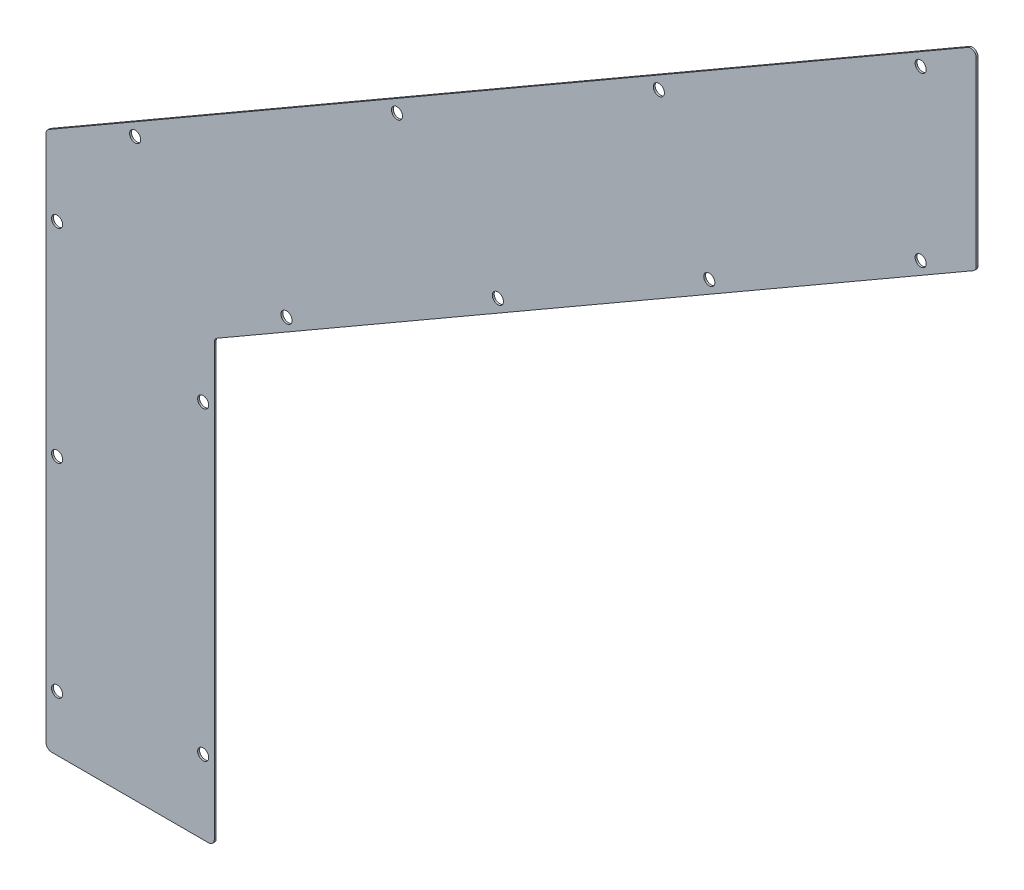
ISO-10303-21;
HEADER;
FILE_DESCRIPTION(('STEP AP214'),'2;1');
FILE_NAME('part.step','',(''),(''),'','','');
FILE_SCHEMA(('AUTOMOTIVE_DESIGN { 1 0 10303 214 1 1 1 1 }'));
ENDSEC;
DATA;
#1=APPLICATION_CONTEXT('core data for automotive mechanical design processes');
#2=APPLICATION_PROTOCOL_DEFINITION('international standard','automotive_design',2000,#1);
#3=PRODUCT_CONTEXT('',#1,'mechanical');
#4=PRODUCT('Part','Part','',(#3));
#5=PRODUCT_RELATED_PRODUCT_CATEGORY('part','',(#4));
#6=PRODUCT_DEFINITION_FORMATION('','',#4);
#7=PRODUCT_DEFINITION_CONTEXT('part definition',#1,'design');
#8=PRODUCT_DEFINITION('design','',#6,#7);
#9=PRODUCT_DEFINITION_SHAPE('','',#8);
#10=(LENGTH_UNIT() NAMED_UNIT(*) SI_UNIT(.MILLI.,.METRE.));
#11=(NAMED_UNIT(*) PLANE_ANGLE_UNIT() SI_UNIT($,.RADIAN.));
#12=(NAMED_UNIT(*) SI_UNIT($,.STERADIAN.) SOLID_ANGLE_UNIT());
#13=UNCERTAINTY_MEASURE_WITH_UNIT(LENGTH_MEASURE(1.E-05),#10,'distance_accuracy_value','');
#14=(GEOMETRIC_REPRESENTATION_CONTEXT(3) GLOBAL_UNCERTAINTY_ASSIGNED_CONTEXT((#13)) GLOBAL_UNIT_ASSIGNED_CONTEXT((#10,
#11,#12)) REPRESENTATION_CONTEXT('',''));
#15=CARTESIAN_POINT('',(0.,0.,0.));
#16=DIRECTION('',(0.,0.,1.));
#17=DIRECTION('',(1.,0.,0.));
#18=AXIS2_PLACEMENT_3D('',#15,#16,#17);
#19=CARTESIAN_POINT('',(-91.,0.,-1.));
#20=DIRECTION('',(0.,-1.,0.));
#21=DIRECTION('',(0.,0.,-1.));
#22=AXIS2_PLACEMENT_3D('',#19,#20,#21);
#23=PLANE('',#22);
#24=DIRECTION('',(1.,0.,0.));
#25=VECTOR('',#24,1.);
#26=CARTESIAN_POINT('',(-91.,0.,0.));
#27=LINE('',#26,#25);
#28=CARTESIAN_POINT('',(-88.,0.,0.));
#29=VERTEX_POINT('',#28);
#30=CARTESIAN_POINT('',(-3.,0.,0.));
#31=VERTEX_POINT('',#30);
#32=EDGE_CURVE('E241',#29,#31,#27,.T.);
#33=ORIENTED_EDGE('',*,*,#32,.F.);
#34=DIRECTION('',(0.,0.,1.));
#35=VECTOR('',#34,1.);
#36=CARTESIAN_POINT('',(-88.,0.,-1.));
#37=LINE('',#36,#35);
#38=CARTESIAN_POINT('',(-88.,0.,-1.));
#39=VERTEX_POINT('',#38);
#40=EDGE_CURVE('E187',#29,#39,#37,.F.);
#41=ORIENTED_EDGE('',*,*,#40,.T.);
#42=DIRECTION('',(1.,0.,0.));
#43=VECTOR('',#42,1.);
#44=CARTESIAN_POINT('',(-91.,0.,-1.));
#45=LINE('',#44,#43);
#46=CARTESIAN_POINT('',(-3.,0.,-1.));
#47=VERTEX_POINT('',#46);
#48=EDGE_CURVE('E274',#39,#47,#45,.T.);
#49=ORIENTED_EDGE('',*,*,#48,.T.);
#50=DIRECTION('',(0.,0.,1.));
#51=VECTOR('',#50,1.);
#52=CARTESIAN_POINT('',(-3.,0.,-1.));
#53=LINE('',#52,#51);
#54=EDGE_CURVE('E184',#47,#31,#53,.T.);
#55=ORIENTED_EDGE('',*,*,#54,.T.);
#56=EDGE_LOOP('',(#33,#41,#49,#55));
#57=FACE_BOUND('',#56,.T.);
#58=ADVANCED_FACE('F40',(#57),#23,.T.);
#59=CARTESIAN_POINT('',(-91.,290.01,-1.));
#60=DIRECTION('',(-1.,0.,0.));
#61=DIRECTION('',(0.,-1.,0.));
#62=AXIS2_PLACEMENT_3D('',#59,#60,#61);
#63=PLANE('',#62);
#64=DIRECTION('',(0.,-1.,0.));
#65=VECTOR('',#64,1.);
#66=CARTESIAN_POINT('',(-91.,290.01,0.));
#67=LINE('',#66,#65);
#68=CARTESIAN_POINT('',(-91.,288.277949192431,0.));
#69=VERTEX_POINT('',#68);
#70=CARTESIAN_POINT('',(-91.,3.,0.));
#71=VERTEX_POINT('',#70);
#72=EDGE_CURVE('E151',#69,#71,#67,.T.);
#73=ORIENTED_EDGE('',*,*,#72,.F.);
#74=DIRECTION('',(0.,0.,1.));
#75=VECTOR('',#74,1.);
#76=CARTESIAN_POINT('',(-91.,288.277949192431,-1.));
#77=LINE('',#76,#75);
#78=CARTESIAN_POINT('',(-91.,288.277949192431,-1.));
#79=VERTEX_POINT('',#78);
#80=EDGE_CURVE('E173',#69,#79,#77,.F.);
#81=ORIENTED_EDGE('',*,*,#80,.T.);
#82=DIRECTION('',(0.,-1.,0.));
#83=VECTOR('',#82,1.);
#84=CARTESIAN_POINT('',(-91.,290.01,-1.));
#85=LINE('',#84,#83);
#86=CARTESIAN_POINT('',(-91.,3.,-1.));
#87=VERTEX_POINT('',#86);
#88=EDGE_CURVE('E155',#79,#87,#85,.T.);
#89=ORIENTED_EDGE('',*,*,#88,.T.);
#90=DIRECTION('',(0.,0.,1.));
#91=VECTOR('',#90,1.);
#92=CARTESIAN_POINT('',(-91.,3.,-1.));
#93=LINE('',#92,#91);
#94=EDGE_CURVE('E170',#87,#71,#93,.T.);
#95=ORIENTED_EDGE('',*,*,#94,.T.);
#96=EDGE_LOOP('',(#73,#81,#89,#95));
#97=FACE_BOUND('',#96,.T.);
#98=ADVANCED_FACE('F293',(#97),#63,.T.);
#99=CARTESIAN_POINT('',(412.,580.41718540238,-1.));
#100=DIRECTION('',(-0.499999999999998,0.86602540378444,0.));
#101=DIRECTION('',(-0.86602540378444,-0.499999999999998,0.));
#102=AXIS2_PLACEMENT_3D('',#99,#100,#101);
#103=PLANE('',#102);
#104=DIRECTION('',(-0.86602540378444,-0.499999999999998,0.));
#105=VECTOR('',#104,1.);
#106=CARTESIAN_POINT('',(412.,580.41718540238,-1.));
#107=LINE('',#106,#105);
#108=CARTESIAN_POINT('',(407.5,577.819109191027,-1.));
#109=VERTEX_POINT('',#108);
#110=CARTESIAN_POINT('',(-89.4999999999999,290.876025403784,-1.));
#111=VERTEX_POINT('',#110);
#112=EDGE_CURVE('E159',#109,#111,#107,.T.);
#113=ORIENTED_EDGE('',*,*,#112,.T.);
#114=DIRECTION('',(0.,0.,1.));
#115=VECTOR('',#114,1.);
#116=CARTESIAN_POINT('',(-89.5,290.876025403784,-1.));
#117=LINE('',#116,#115);
#118=CARTESIAN_POINT('',(-89.4999999999999,290.876025403784,0.));
#119=VERTEX_POINT('',#118);
#120=EDGE_CURVE('E142',#111,#119,#117,.T.);
#121=ORIENTED_EDGE('',*,*,#120,.T.);
#122=DIRECTION('',(-0.86602540378444,-0.499999999999998,0.));
#123=VECTOR('',#122,1.);
#124=CARTESIAN_POINT('',(412.,580.41718540238,0.));
#125=LINE('',#124,#123);
#126=CARTESIAN_POINT('',(407.5,577.819109191027,0.));
#127=VERTEX_POINT('',#126);
#128=EDGE_CURVE('E134',#127,#119,#125,.T.);
#129=ORIENTED_EDGE('',*,*,#128,.F.);
#130=DIRECTION('',(0.,0.,1.));
#131=VECTOR('',#130,1.);
#132=CARTESIAN_POINT('',(407.5,577.819109191027,-1.));
#133=LINE('',#132,#131);
#134=EDGE_CURVE('E148',#127,#109,#133,.F.);
#135=ORIENTED_EDGE('',*,*,#134,.T.);
#136=EDGE_LOOP('',(#113,#121,#129,#135));
#137=FACE_BOUND('',#136,.T.);
#138=ADVANCED_FACE('F147',(#137),#103,.T.);
#139=CARTESIAN_POINT('',(412.,475.605017533696,-1.));
#140=DIRECTION('',(1.,0.,0.));
#141=DIRECTION('',(0.,0.,-1.));
#142=AXIS2_PLACEMENT_3D('',#139,#140,#141);
#143=PLANE('',#142);
#144=DIRECTION('',(0.,1.,0.));
#145=VECTOR('',#144,1.);
#146=CARTESIAN_POINT('',(412.,475.605017533696,0.));
#147=LINE('',#146,#145);
#148=CARTESIAN_POINT('',(412.,477.337068341265,0.));
#149=VERTEX_POINT('',#148);
#150=CARTESIAN_POINT('',(412.,575.221032979674,0.));
#151=VERTEX_POINT('',#150);
#152=EDGE_CURVE('E136',#149,#151,#147,.T.);
#153=ORIENTED_EDGE('',*,*,#152,.F.);
#154=DIRECTION('',(0.,0.,1.));
#155=VECTOR('',#154,1.);
#156=CARTESIAN_POINT('',(412.,477.337068341265,-1.));
#157=LINE('',#156,#155);
#158=CARTESIAN_POINT('',(412.,477.337068341265,-1.));
#159=VERTEX_POINT('',#158);
#160=EDGE_CURVE('E200',#149,#159,#157,.F.);
#161=ORIENTED_EDGE('',*,*,#160,.T.);
#162=DIRECTION('',(0.,1.,0.));
#163=VECTOR('',#162,1.);
#164=CARTESIAN_POINT('',(412.,475.605017533696,-1.));
#165=LINE('',#164,#163);
#166=CARTESIAN_POINT('',(412.,575.221032979674,-1.));
#167=VERTEX_POINT('',#166);
#168=EDGE_CURVE('E285',#159,#167,#165,.T.);
#169=ORIENTED_EDGE('',*,*,#168,.T.);
#170=DIRECTION('',(0.,0.,1.));
#171=VECTOR('',#170,1.);
#172=CARTESIAN_POINT('',(412.,575.221032979674,-1.));
#173=LINE('',#172,#171);
#174=EDGE_CURVE('E198',#167,#151,#173,.T.);
#175=ORIENTED_EDGE('',*,*,#174,.T.);
#176=EDGE_LOOP('',(#153,#161,#169,#175));
#177=FACE_BOUND('',#176,.T.);
#178=ADVANCED_FACE('F338',(#177),#143,.T.);
#179=CARTESIAN_POINT('',(0.,237.736706627571,-1.));
#180=DIRECTION('',(0.499999999999998,-0.86602540378444,0.));
#181=DIRECTION('',(0.86602540378444,0.499999999999998,0.));
#182=AXIS2_PLACEMENT_3D('',#179,#180,#181);
#183=PLANE('',#182);
#184=DIRECTION('',(0.86602540378444,0.499999999999998,0.));
#185=VECTOR('',#184,1.);
#186=CARTESIAN_POINT('',(0.,237.736706627571,0.));
#187=LINE('',#186,#185);
#188=CARTESIAN_POINT('',(1.50000000000001,238.602732031356,0.));
#189=VERTEX_POINT('',#188);
#190=CARTESIAN_POINT('',(410.5,474.738992129911,0.));
#191=VERTEX_POINT('',#190);
#192=EDGE_CURVE('E249',#189,#191,#187,.T.);
#193=ORIENTED_EDGE('',*,*,#192,.F.);
#194=DIRECTION('',(0.,0.,1.));
#195=VECTOR('',#194,1.);
#196=CARTESIAN_POINT('',(1.50000000000001,238.602732031356,-1.));
#197=LINE('',#196,#195);
#198=CARTESIAN_POINT('',(1.50000000000001,238.602732031356,-1.));
#199=VERTEX_POINT('',#198);
#200=EDGE_CURVE('E196',#189,#199,#197,.F.);
#201=ORIENTED_EDGE('',*,*,#200,.T.);
#202=DIRECTION('',(0.86602540378444,0.499999999999998,0.));
#203=VECTOR('',#202,1.);
#204=CARTESIAN_POINT('',(0.,237.736706627571,-1.));
#205=LINE('',#204,#203);
#206=CARTESIAN_POINT('',(410.5,474.738992129911,-1.));
#207=VERTEX_POINT('',#206);
#208=EDGE_CURVE('E277',#199,#207,#205,.T.);
#209=ORIENTED_EDGE('',*,*,#208,.T.);
#210=DIRECTION('',(0.,0.,1.));
#211=VECTOR('',#210,1.);
#212=CARTESIAN_POINT('',(410.5,474.738992129911,-1.));
#213=LINE('',#212,#211);
#214=EDGE_CURVE('E193',#207,#191,#213,.T.);
#215=ORIENTED_EDGE('',*,*,#214,.T.);
#216=EDGE_LOOP('',(#193,#201,#209,#215));
#217=FACE_BOUND('',#216,.T.);
#218=ADVANCED_FACE('F258',(#217),#183,.T.);
#219=CARTESIAN_POINT('',(0.,0.,-1.));
#220=DIRECTION('',(1.,0.,0.));
#221=DIRECTION('',(0.,0.,-1.));
#222=AXIS2_PLACEMENT_3D('',#219,#220,#221);
#223=PLANE('',#222);
#224=DIRECTION('',(0.,1.,0.));
#225=VECTOR('',#224,1.);
#226=CARTESIAN_POINT('',(0.,0.,0.));
#227=LINE('',#226,#225);
#228=CARTESIAN_POINT('',(0.,3.,0.));
#229=VERTEX_POINT('',#228);
#230=CARTESIAN_POINT('',(0.,236.004655820002,0.));
#231=VERTEX_POINT('',#230);
#232=EDGE_CURVE('E245',#229,#231,#227,.T.);
#233=ORIENTED_EDGE('',*,*,#232,.F.);
#234=DIRECTION('',(0.,0.,1.));
#235=VECTOR('',#234,1.);
#236=CARTESIAN_POINT('',(0.,3.,-1.));
#237=LINE('',#236,#235);
#238=CARTESIAN_POINT('',(0.,3.,-1.));
#239=VERTEX_POINT('',#238);
#240=EDGE_CURVE('E62',#229,#239,#237,.F.);
#241=ORIENTED_EDGE('',*,*,#240,.T.);
#242=DIRECTION('',(0.,1.,0.));
#243=VECTOR('',#242,1.);
#244=CARTESIAN_POINT('',(0.,0.,-1.));
#245=LINE('',#244,#243);
#246=CARTESIAN_POINT('',(0.,236.004655820002,-1.));
#247=VERTEX_POINT('',#246);
#248=EDGE_CURVE('E265',#239,#247,#245,.T.);
#249=ORIENTED_EDGE('',*,*,#248,.T.);
#250=DIRECTION('',(0.,0.,1.));
#251=VECTOR('',#250,1.);
#252=CARTESIAN_POINT('',(0.,236.004655820002,0.));
#253=LINE('',#252,#251);
#254=EDGE_CURVE('E189',#247,#231,#253,.T.);
#255=ORIENTED_EDGE('',*,*,#254,.T.);
#256=EDGE_LOOP('',(#233,#241,#249,#255));
#257=FACE_BOUND('',#256,.T.);
#258=ADVANCED_FACE('F264',(#257),#223,.T.);
#259=CARTESIAN_POINT('',(0.,0.,-1.));
#260=DIRECTION('',(0.,0.,1.));
#261=DIRECTION('',(1.,0.,0.));
#262=AXIS2_PLACEMENT_3D('',#259,#260,#261);
#263=PLANE('',#262);
#264=CARTESIAN_POINT('',(382.,556.168474096416,-1.));
#265=DIRECTION('',(0.,0.,-1.));
#266=DIRECTION('',(-1.,0.,0.));
#267=AXIS2_PLACEMENT_3D('',#264,#265,#266);
#268=CIRCLE('',#267,2.99999999999999);
#269=CARTESIAN_POINT('',(379.,556.168474096416,-1.));
#270=VERTEX_POINT('',#269);
#271=EDGE_CURVE('E207',#270,#270,#268,.T.);
#272=ORIENTED_EDGE('',*,*,#271,.F.);
#273=EDGE_LOOP('',(#272));
#274=FACE_BOUND('',#273,.T.);
#275=CARTESIAN_POINT('',(-6.00000000000001,205.,-1.));
#276=DIRECTION('',(0.,0.,-1.));
#277=DIRECTION('',(-1.,0.,0.));
#278=AXIS2_PLACEMENT_3D('',#275,#276,#277);
#279=CIRCLE('',#278,3.);
#280=CARTESIAN_POINT('',(-9.00000000000001,205.,-1.));
#281=VERTEX_POINT('',#280);
#282=EDGE_CURVE('E608',#281,#281,#279,.T.);
#283=ORIENTED_EDGE('',*,*,#282,.F.);
#284=EDGE_LOOP('',(#283));
#285=FACE_BOUND('',#284,.T.);
#286=CARTESIAN_POINT('',(-84.9999999999992,250.,-1.));
#287=DIRECTION('',(0.,0.,-1.));
#288=DIRECTION('',(-1.,0.,0.));
#289=AXIS2_PLACEMENT_3D('',#286,#287,#288);
#290=CIRCLE('',#289,3.00000000000001);
#291=CARTESIAN_POINT('',(-87.9999999999992,250.,-1.));
#292=VERTEX_POINT('',#291);
#293=EDGE_CURVE('E605',#292,#292,#290,.T.);
#294=ORIENTED_EDGE('',*,*,#293,.F.);
#295=EDGE_LOOP('',(#294));
#296=FACE_BOUND('',#295,.T.);
#297=CARTESIAN_POINT('',(-84.9999999999996,140.,-1.));
#298=DIRECTION('',(0.,0.,-1.));
#299=DIRECTION('',(-1.,0.,0.));
#300=AXIS2_PLACEMENT_3D('',#297,#298,#299);
#301=CIRCLE('',#300,3.00000000000001);
#302=CARTESIAN_POINT('',(-87.9999999999996,140.,-1.));
#303=VERTEX_POINT('',#302);
#304=EDGE_CURVE('E602',#303,#303,#301,.T.);
#305=ORIENTED_EDGE('',*,*,#304,.F.);
#306=EDGE_LOOP('',(#305));
#307=FACE_BOUND('',#306,.T.);
#308=CARTESIAN_POINT('',(-6.00000000000001,40.,-1.));
#309=DIRECTION('',(0.,0.,-1.));
#310=DIRECTION('',(-1.,0.,0.));
#311=AXIS2_PLACEMENT_3D('',#308,#309,#310);
#312=CIRCLE('',#311,3.);
#313=CARTESIAN_POINT('',(-9.00000000000001,40.,-1.));
#314=VERTEX_POINT('',#313);
#315=EDGE_CURVE('E598',#314,#314,#312,.T.);
#316=ORIENTED_EDGE('',*,*,#315,.F.);
#317=EDGE_LOOP('',(#316));
#318=FACE_BOUND('',#317,.T.);
#319=CARTESIAN_POINT('',(382.,465.212712688284,-1.));
#320=DIRECTION('',(0.,0.,-1.));
#321=DIRECTION('',(-1.,0.,0.));
#322=AXIS2_PLACEMENT_3D('',#319,#320,#321);
#323=CIRCLE('',#322,2.99999999999999);
#324=CARTESIAN_POINT('',(379.,465.212712688284,-1.));
#325=VERTEX_POINT('',#324);
#326=EDGE_CURVE('E592',#325,#325,#323,.T.);
#327=ORIENTED_EDGE('',*,*,#326,.F.);
#328=EDGE_LOOP('',(#327));
#329=FACE_BOUND('',#328,.T.);
#330=CARTESIAN_POINT('',(240.404846481244,474.418474096416,-1.));
#331=DIRECTION('',(0.,0.,-1.));
#332=DIRECTION('',(-1.,0.,0.));
#333=AXIS2_PLACEMENT_3D('',#330,#331,#332);
#334=CIRCLE('',#333,2.99999999999999);
#335=CARTESIAN_POINT('',(237.404846481244,474.418474096416,-1.));
#336=VERTEX_POINT('',#335);
#337=EDGE_CURVE('E595',#336,#336,#334,.T.);
#338=ORIENTED_EDGE('',*,*,#337,.F.);
#339=EDGE_LOOP('',(#338));
#340=FACE_BOUND('',#339,.T.);
#341=CARTESIAN_POINT('',(98.8096929624882,392.668474096417,-1.));
#342=DIRECTION('',(0.,0.,-1.));
#343=DIRECTION('',(-1.,0.,0.));
#344=AXIS2_PLACEMENT_3D('',#341,#342,#343);
#345=CIRCLE('',#344,3.00000000000001);
#346=CARTESIAN_POINT('',(95.8096929624882,392.668474096417,-1.));
#347=VERTEX_POINT('',#346);
#348=EDGE_CURVE('E623',#347,#347,#345,.T.);
#349=ORIENTED_EDGE('',*,*,#348,.F.);
#350=EDGE_LOOP('',(#349));
#351=FACE_BOUND('',#350,.T.);
#352=CARTESIAN_POINT('',(-42.7854605562677,310.918474096417,-1.));
#353=DIRECTION('',(0.,0.,-1.));
#354=DIRECTION('',(-1.,0.,0.));
#355=AXIS2_PLACEMENT_3D('',#352,#353,#354);
#356=CIRCLE('',#355,3.);
#357=CARTESIAN_POINT('',(-45.7854605562677,310.918474096417,-1.));
#358=VERTEX_POINT('',#357);
#359=EDGE_CURVE('E281',#358,#358,#356,.T.);
#360=ORIENTED_EDGE('',*,*,#359,.F.);
#361=EDGE_LOOP('',(#360));
#362=FACE_BOUND('',#361,.T.);
#363=CARTESIAN_POINT('',(39.0539401013619,267.212712688284,-1.));
#364=DIRECTION('',(0.,0.,-1.));
#365=DIRECTION('',(-1.,0.,0.));
#366=AXIS2_PLACEMENT_3D('',#363,#364,#365);
#367=CIRCLE('',#366,3.);
#368=CARTESIAN_POINT('',(36.0539401013619,267.212712688284,-1.));
#369=VERTEX_POINT('',#368);
#370=EDGE_CURVE('E601',#369,#369,#367,.T.);
#371=ORIENTED_EDGE('',*,*,#370,.F.);
#372=EDGE_LOOP('',(#371));
#373=FACE_BOUND('',#372,.T.);
#374=CARTESIAN_POINT('',(153.369293400908,333.212712688284,-1.));
#375=DIRECTION('',(0.,0.,-1.));
#376=DIRECTION('',(-1.,0.,0.));
#377=AXIS2_PLACEMENT_3D('',#374,#375,#376);
#378=CIRCLE('',#377,2.99999999999999);
#379=CARTESIAN_POINT('',(150.369293400908,333.212712688284,-1.));
#380=VERTEX_POINT('',#379);
#381=EDGE_CURVE('E611',#380,#380,#378,.T.);
#382=ORIENTED_EDGE('',*,*,#381,.F.);
#383=EDGE_LOOP('',(#382));
#384=FACE_BOUND('',#383,.T.);
#385=CARTESIAN_POINT('',(267.684646700454,399.212712688284,-1.));
#386=DIRECTION('',(0.,0.,-1.));
#387=DIRECTION('',(-1.,0.,0.));
#388=AXIS2_PLACEMENT_3D('',#385,#386,#387);
#389=CIRCLE('',#388,2.99999999999999);
#390=CARTESIAN_POINT('',(264.684646700454,399.212712688284,-1.));
#391=VERTEX_POINT('',#390);
#392=EDGE_CURVE('E614',#391,#391,#389,.T.);
#393=ORIENTED_EDGE('',*,*,#392,.F.);
#394=EDGE_LOOP('',(#393));
#395=FACE_BOUND('',#394,.T.);
#396=CARTESIAN_POINT('',(-85.,30.,-1.));
#397=DIRECTION('',(0.,0.,-1.));
#398=DIRECTION('',(-1.,0.,0.));
#399=AXIS2_PLACEMENT_3D('',#396,#397,#398);
#400=CIRCLE('',#399,3.00000000000001);
#401=CARTESIAN_POINT('',(-88.,30.,-1.));
#402=VERTEX_POINT('',#401);
#403=EDGE_CURVE('E617',#402,#402,#400,.T.);
#404=ORIENTED_EDGE('',*,*,#403,.F.);
#405=EDGE_LOOP('',(#404));
#406=FACE_BOUND('',#405,.T.);
#407=ORIENTED_EDGE('',*,*,#88,.F.);
#408=CARTESIAN_POINT('',(-88.,288.277949192431,-1.));
#409=DIRECTION('',(0.,0.,1.));
#410=DIRECTION('',(1.,0.,0.));
#411=AXIS2_PLACEMENT_3D('',#408,#409,#410);
#412=CIRCLE('',#411,3.);
#413=EDGE_CURVE('E182',#79,#111,#412,.F.);
#414=ORIENTED_EDGE('',*,*,#413,.T.);
#415=ORIENTED_EDGE('',*,*,#112,.F.);
#416=CARTESIAN_POINT('',(409.,575.221032979674,-1.));
#417=DIRECTION('',(0.,0.,1.));
#418=DIRECTION('',(1.,0.,0.));
#419=AXIS2_PLACEMENT_3D('',#416,#417,#418);
#420=CIRCLE('',#419,3.);
#421=EDGE_CURVE('E154',#109,#167,#420,.F.);
#422=ORIENTED_EDGE('',*,*,#421,.T.);
#423=ORIENTED_EDGE('',*,*,#168,.F.);
#424=CARTESIAN_POINT('',(409.,477.337068341265,-1.));
#425=DIRECTION('',(0.,0.,1.));
#426=DIRECTION('',(1.,0.,0.));
#427=AXIS2_PLACEMENT_3D('',#424,#425,#426);
#428=CIRCLE('',#427,3.);
#429=EDGE_CURVE('E176',#159,#207,#428,.F.);
#430=ORIENTED_EDGE('',*,*,#429,.T.);
#431=ORIENTED_EDGE('',*,*,#208,.F.);
#432=CARTESIAN_POINT('',(3.,236.004655820002,-1.));
#433=DIRECTION('',(0.,0.,1.));
#434=DIRECTION('',(1.,0.,0.));
#435=AXIS2_PLACEMENT_3D('',#432,#433,#434);
#436=CIRCLE('',#435,3.);
#437=EDGE_CURVE('E11',#199,#247,#436,.T.);
#438=ORIENTED_EDGE('',*,*,#437,.T.);
#439=ORIENTED_EDGE('',*,*,#248,.F.);
#440=CARTESIAN_POINT('',(-3.,3.,-1.));
#441=DIRECTION('',(0.,0.,1.));
#442=DIRECTION('',(1.,0.,0.));
#443=AXIS2_PLACEMENT_3D('',#440,#441,#442);
#444=CIRCLE('',#443,3.);
#445=EDGE_CURVE('E178',#239,#47,#444,.F.);
#446=ORIENTED_EDGE('',*,*,#445,.T.);
#447=ORIENTED_EDGE('',*,*,#48,.F.);
#448=CARTESIAN_POINT('',(-88.,3.,-1.));
#449=DIRECTION('',(0.,0.,1.));
#450=DIRECTION('',(1.,0.,0.));
#451=AXIS2_PLACEMENT_3D('',#448,#449,#450);
#452=CIRCLE('',#451,3.);
#453=EDGE_CURVE('E180',#39,#87,#452,.F.);
#454=ORIENTED_EDGE('',*,*,#453,.T.);
#455=EDGE_LOOP('',(#407,#414,#415,#422,#423,#430,#431,#438,#439,#446,#447,#454));
#456=FACE_BOUND('',#455,.T.);
#457=ADVANCED_FACE('F298',(#274,#285,#296,#307,#318,#329,#340,#351,#362,#373,#384,#395,#406,
#456),#263,.F.);
#458=CARTESIAN_POINT('',(0.,0.,0.));
#459=DIRECTION('',(0.,0.,1.));
#460=DIRECTION('',(1.,0.,0.));
#461=AXIS2_PLACEMENT_3D('',#458,#459,#460);
#462=PLANE('',#461);
#463=CARTESIAN_POINT('',(382.,556.168474096416,0.));
#464=DIRECTION('',(0.,0.,1.));
#465=DIRECTION('',(1.,0.,0.));
#466=AXIS2_PLACEMENT_3D('',#463,#464,#465);
#467=CIRCLE('',#466,2.99999999999999);
#468=CARTESIAN_POINT('',(385.,556.168474096416,0.));
#469=VERTEX_POINT('',#468);
#470=EDGE_CURVE('E44',#469,#469,#467,.T.);
#471=ORIENTED_EDGE('',*,*,#470,.F.);
#472=EDGE_LOOP('',(#471));
#473=FACE_BOUND('',#472,.T.);
#474=CARTESIAN_POINT('',(-6.00000000000001,205.,0.));
#475=DIRECTION('',(0.,0.,1.));
#476=DIRECTION('',(1.,0.,0.));
#477=AXIS2_PLACEMENT_3D('',#474,#475,#476);
#478=CIRCLE('',#477,3.);
#479=CARTESIAN_POINT('',(-3.00000000000001,205.,0.));
#480=VERTEX_POINT('',#479);
#481=EDGE_CURVE('E236',#480,#480,#478,.T.);
#482=ORIENTED_EDGE('',*,*,#481,.F.);
#483=EDGE_LOOP('',(#482));
#484=FACE_BOUND('',#483,.T.);
#485=CARTESIAN_POINT('',(-84.9999999999992,250.,0.));
#486=DIRECTION('',(0.,0.,1.));
#487=DIRECTION('',(1.,0.,0.));
#488=AXIS2_PLACEMENT_3D('',#485,#486,#487);
#489=CIRCLE('',#488,3.00000000000001);
#490=CARTESIAN_POINT('',(-81.9999999999992,250.,0.));
#491=VERTEX_POINT('',#490);
#492=EDGE_CURVE('E234',#491,#491,#489,.T.);
#493=ORIENTED_EDGE('',*,*,#492,.F.);
#494=EDGE_LOOP('',(#493));
#495=FACE_BOUND('',#494,.T.);
#496=CARTESIAN_POINT('',(-84.9999999999996,140.,0.));
#497=DIRECTION('',(0.,0.,1.));
#498=DIRECTION('',(1.,0.,0.));
#499=AXIS2_PLACEMENT_3D('',#496,#497,#498);
#500=CIRCLE('',#499,3.00000000000001);
#501=CARTESIAN_POINT('',(-81.9999999999996,140.,0.));
#502=VERTEX_POINT('',#501);
#503=EDGE_CURVE('E231',#502,#502,#500,.T.);
#504=ORIENTED_EDGE('',*,*,#503,.F.);
#505=EDGE_LOOP('',(#504));
#506=FACE_BOUND('',#505,.T.);
#507=CARTESIAN_POINT('',(-6.00000000000001,40.,0.));
#508=DIRECTION('',(0.,0.,1.));
#509=DIRECTION('',(1.,0.,0.));
#510=AXIS2_PLACEMENT_3D('',#507,#508,#509);
#511=CIRCLE('',#510,3.);
#512=CARTESIAN_POINT('',(-3.00000000000001,40.,0.));
#513=VERTEX_POINT('',#512);
#514=EDGE_CURVE('E228',#513,#513,#511,.T.);
#515=ORIENTED_EDGE('',*,*,#514,.F.);
#516=EDGE_LOOP('',(#515));
#517=FACE_BOUND('',#516,.T.);
#518=CARTESIAN_POINT('',(382.,465.212712688284,0.));
#519=DIRECTION('',(0.,0.,1.));
#520=DIRECTION('',(1.,0.,0.));
#521=AXIS2_PLACEMENT_3D('',#518,#519,#520);
#522=CIRCLE('',#521,2.99999999999999);
#523=CARTESIAN_POINT('',(385.,465.212712688284,0.));
#524=VERTEX_POINT('',#523);
#525=EDGE_CURVE('E225',#524,#524,#522,.T.);
#526=ORIENTED_EDGE('',*,*,#525,.F.);
#527=EDGE_LOOP('',(#526));
#528=FACE_BOUND('',#527,.T.);
#529=CARTESIAN_POINT('',(240.404846481244,474.418474096416,0.));
#530=DIRECTION('',(0.,0.,1.));
#531=DIRECTION('',(1.,0.,0.));
#532=AXIS2_PLACEMENT_3D('',#529,#530,#531);
#533=CIRCLE('',#532,2.99999999999999);
#534=CARTESIAN_POINT('',(243.404846481244,474.418474096416,0.));
#535=VERTEX_POINT('',#534);
#536=EDGE_CURVE('E222',#535,#535,#533,.T.);
#537=ORIENTED_EDGE('',*,*,#536,.F.);
#538=EDGE_LOOP('',(#537));
#539=FACE_BOUND('',#538,.T.);
#540=CARTESIAN_POINT('',(98.8096929624882,392.668474096417,0.));
#541=DIRECTION('',(0.,0.,1.));
#542=DIRECTION('',(1.,0.,0.));
#543=AXIS2_PLACEMENT_3D('',#540,#541,#542);
#544=CIRCLE('',#543,3.00000000000001);
#545=CARTESIAN_POINT('',(101.809692962488,392.668474096417,0.));
#546=VERTEX_POINT('',#545);
#547=EDGE_CURVE('E219',#546,#546,#544,.T.);
#548=ORIENTED_EDGE('',*,*,#547,.F.);
#549=EDGE_LOOP('',(#548));
#550=FACE_BOUND('',#549,.T.);
#551=CARTESIAN_POINT('',(-42.7854605562677,310.918474096417,0.));
#552=DIRECTION('',(0.,0.,1.));
#553=DIRECTION('',(1.,0.,0.));
#554=AXIS2_PLACEMENT_3D('',#551,#552,#553);
#555=CIRCLE('',#554,3.);
#556=CARTESIAN_POINT('',(-39.7854605562677,310.918474096417,0.));
#557=VERTEX_POINT('',#556);
#558=EDGE_CURVE('E216',#557,#557,#555,.T.);
#559=ORIENTED_EDGE('',*,*,#558,.F.);
#560=EDGE_LOOP('',(#559));
#561=FACE_BOUND('',#560,.T.);
#562=CARTESIAN_POINT('',(39.0539401013619,267.212712688284,0.));
#563=DIRECTION('',(0.,0.,1.));
#564=DIRECTION('',(1.,0.,0.));
#565=AXIS2_PLACEMENT_3D('',#562,#563,#564);
#566=CIRCLE('',#565,3.);
#567=CARTESIAN_POINT('',(42.0539401013619,267.212712688284,0.));
#568=VERTEX_POINT('',#567);
#569=EDGE_CURVE('E213',#568,#568,#566,.T.);
#570=ORIENTED_EDGE('',*,*,#569,.F.);
#571=EDGE_LOOP('',(#570));
#572=FACE_BOUND('',#571,.T.);
#573=CARTESIAN_POINT('',(153.369293400908,333.212712688284,0.));
#574=DIRECTION('',(0.,0.,1.));
#575=DIRECTION('',(1.,0.,0.));
#576=AXIS2_PLACEMENT_3D('',#573,#574,#575);
#577=CIRCLE('',#576,2.99999999999999);
#578=CARTESIAN_POINT('',(156.369293400908,333.212712688284,0.));
#579=VERTEX_POINT('',#578);
#580=EDGE_CURVE('E210',#579,#579,#577,.T.);
#581=ORIENTED_EDGE('',*,*,#580,.F.);
#582=EDGE_LOOP('',(#581));
#583=FACE_BOUND('',#582,.T.);
#584=CARTESIAN_POINT('',(267.684646700454,399.212712688284,0.));
#585=DIRECTION('',(0.,0.,1.));
#586=DIRECTION('',(1.,0.,0.));
#587=AXIS2_PLACEMENT_3D('',#584,#585,#586);
#588=CIRCLE('',#587,2.99999999999999);
#589=CARTESIAN_POINT('',(270.684646700454,399.212712688284,0.));
#590=VERTEX_POINT('',#589);
#591=EDGE_CURVE('E206',#590,#590,#588,.T.);
#592=ORIENTED_EDGE('',*,*,#591,.F.);
#593=EDGE_LOOP('',(#592));
#594=FACE_BOUND('',#593,.T.);
#595=CARTESIAN_POINT('',(-85.,30.,0.));
#596=DIRECTION('',(0.,0.,1.));
#597=DIRECTION('',(1.,0.,0.));
#598=AXIS2_PLACEMENT_3D('',#595,#596,#597);
#599=CIRCLE('',#598,3.00000000000001);
#600=CARTESIAN_POINT('',(-82.,30.,0.));
#601=VERTEX_POINT('',#600);
#602=EDGE_CURVE('E203',#601,#601,#599,.T.);
#603=ORIENTED_EDGE('',*,*,#602,.F.);
#604=EDGE_LOOP('',(#603));
#605=FACE_BOUND('',#604,.T.);
#606=ORIENTED_EDGE('',*,*,#128,.T.);
#607=CARTESIAN_POINT('',(-88.,288.277949192431,0.));
#608=DIRECTION('',(0.,0.,1.));
#609=DIRECTION('',(1.,0.,0.));
#610=AXIS2_PLACEMENT_3D('',#607,#608,#609);
#611=CIRCLE('',#610,3.);
#612=EDGE_CURVE('E168',#119,#69,#611,.T.);
#613=ORIENTED_EDGE('',*,*,#612,.T.);
#614=ORIENTED_EDGE('',*,*,#72,.T.);
#615=CARTESIAN_POINT('',(-88.,3.,0.));
#616=DIRECTION('',(0.,0.,1.));
#617=DIRECTION('',(1.,0.,0.));
#618=AXIS2_PLACEMENT_3D('',#615,#616,#617);
#619=CIRCLE('',#618,3.);
#620=EDGE_CURVE('E166',#71,#29,#619,.T.);
#621=ORIENTED_EDGE('',*,*,#620,.T.);
#622=ORIENTED_EDGE('',*,*,#32,.T.);
#623=CARTESIAN_POINT('',(-3.,3.,0.));
#624=DIRECTION('',(0.,0.,1.));
#625=DIRECTION('',(1.,0.,0.));
#626=AXIS2_PLACEMENT_3D('',#623,#624,#625);
#627=CIRCLE('',#626,3.);
#628=EDGE_CURVE('E164',#31,#229,#627,.T.);
#629=ORIENTED_EDGE('',*,*,#628,.T.);
#630=ORIENTED_EDGE('',*,*,#232,.T.);
#631=CARTESIAN_POINT('',(3.,236.004655820002,0.));
#632=DIRECTION('',(0.,0.,1.));
#633=DIRECTION('',(1.,0.,0.));
#634=AXIS2_PLACEMENT_3D('',#631,#632,#633);
#635=CIRCLE('',#634,3.);
#636=EDGE_CURVE('E49',#231,#189,#635,.F.);
#637=ORIENTED_EDGE('',*,*,#636,.T.);
#638=ORIENTED_EDGE('',*,*,#192,.T.);
#639=CARTESIAN_POINT('',(409.,477.337068341265,0.));
#640=DIRECTION('',(0.,0.,1.));
#641=DIRECTION('',(1.,0.,0.));
#642=AXIS2_PLACEMENT_3D('',#639,#640,#641);
#643=CIRCLE('',#642,3.);
#644=EDGE_CURVE('E141',#191,#149,#643,.T.);
#645=ORIENTED_EDGE('',*,*,#644,.T.);
#646=ORIENTED_EDGE('',*,*,#152,.T.);
#647=CARTESIAN_POINT('',(409.,575.221032979674,0.));
#648=DIRECTION('',(0.,0.,1.));
#649=DIRECTION('',(1.,0.,0.));
#650=AXIS2_PLACEMENT_3D('',#647,#648,#649);
#651=CIRCLE('',#650,3.);
#652=EDGE_CURVE('E131',#151,#127,#651,.T.);
#653=ORIENTED_EDGE('',*,*,#652,.T.);
#654=EDGE_LOOP('',(#606,#613,#614,#621,#622,#629,#630,#637,#638,#645,#646,#653));
#655=FACE_BOUND('',#654,.T.);
#656=ADVANCED_FACE('F133',(#473,#484,#495,#506,#517,#528,#539,#550,#561,#572,#583,#594,#605,
#655),#462,.T.);
#657=CARTESIAN_POINT('',(-88.,288.277949192431,-1.));
#658=DIRECTION('',(0.,0.,1.));
#659=DIRECTION('',(1.,0.,0.));
#660=AXIS2_PLACEMENT_3D('',#657,#658,#659);
#661=CYLINDRICAL_SURFACE('',#660,3.);
#662=ORIENTED_EDGE('',*,*,#413,.F.);
#663=ORIENTED_EDGE('',*,*,#80,.F.);
#664=ORIENTED_EDGE('',*,*,#612,.F.);
#665=ORIENTED_EDGE('',*,*,#120,.F.);
#666=EDGE_LOOP('',(#662,#663,#664,#665));
#667=FACE_BOUND('',#666,.T.);
#668=ADVANCED_FACE('F289',(#667),#661,.T.);
#669=CARTESIAN_POINT('',(-88.,3.,-1.));
#670=DIRECTION('',(0.,0.,1.));
#671=DIRECTION('',(1.,0.,0.));
#672=AXIS2_PLACEMENT_3D('',#669,#670,#671);
#673=CYLINDRICAL_SURFACE('',#672,3.);
#674=ORIENTED_EDGE('',*,*,#453,.F.);
#675=ORIENTED_EDGE('',*,*,#40,.F.);
#676=ORIENTED_EDGE('',*,*,#620,.F.);
#677=ORIENTED_EDGE('',*,*,#94,.F.);
#678=EDGE_LOOP('',(#674,#675,#676,#677));
#679=FACE_BOUND('',#678,.T.);
#680=ADVANCED_FACE('F297',(#679),#673,.T.);
#681=CARTESIAN_POINT('',(-3.,3.,-1.));
#682=DIRECTION('',(0.,0.,1.));
#683=DIRECTION('',(1.,0.,0.));
#684=AXIS2_PLACEMENT_3D('',#681,#682,#683);
#685=CYLINDRICAL_SURFACE('',#684,3.);
#686=ORIENTED_EDGE('',*,*,#445,.F.);
#687=ORIENTED_EDGE('',*,*,#240,.F.);
#688=ORIENTED_EDGE('',*,*,#628,.F.);
#689=ORIENTED_EDGE('',*,*,#54,.F.);
#690=EDGE_LOOP('',(#686,#687,#688,#689));
#691=FACE_BOUND('',#690,.T.);
#692=ADVANCED_FACE('F269',(#691),#685,.T.);
#693=CARTESIAN_POINT('',(3.,236.004655820002,-1.));
#694=DIRECTION('',(0.,0.,-1.));
#695=DIRECTION('',(-1.,0.,0.));
#696=AXIS2_PLACEMENT_3D('',#693,#694,#695);
#697=CYLINDRICAL_SURFACE('',#696,3.);
#698=ORIENTED_EDGE('',*,*,#437,.F.);
#699=ORIENTED_EDGE('',*,*,#200,.F.);
#700=ORIENTED_EDGE('',*,*,#636,.F.);
#701=ORIENTED_EDGE('',*,*,#254,.F.);
#702=EDGE_LOOP('',(#698,#699,#700,#701));
#703=FACE_BOUND('',#702,.T.);
#704=ADVANCED_FACE('F262',(#703),#697,.F.);
#705=CARTESIAN_POINT('',(409.,477.337068341265,-1.));
#706=DIRECTION('',(0.,0.,1.));
#707=DIRECTION('',(1.,0.,0.));
#708=AXIS2_PLACEMENT_3D('',#705,#706,#707);
#709=CYLINDRICAL_SURFACE('',#708,3.);
#710=ORIENTED_EDGE('',*,*,#429,.F.);
#711=ORIENTED_EDGE('',*,*,#160,.F.);
#712=ORIENTED_EDGE('',*,*,#644,.F.);
#713=ORIENTED_EDGE('',*,*,#214,.F.);
#714=EDGE_LOOP('',(#710,#711,#712,#713));
#715=FACE_BOUND('',#714,.T.);
#716=ADVANCED_FACE('F327',(#715),#709,.T.);
#717=CARTESIAN_POINT('',(409.,575.221032979674,-1.));
#718=DIRECTION('',(0.,0.,1.));
#719=DIRECTION('',(1.,0.,0.));
#720=AXIS2_PLACEMENT_3D('',#717,#718,#719);
#721=CYLINDRICAL_SURFACE('',#720,3.);
#722=ORIENTED_EDGE('',*,*,#421,.F.);
#723=ORIENTED_EDGE('',*,*,#134,.F.);
#724=ORIENTED_EDGE('',*,*,#652,.F.);
#725=ORIENTED_EDGE('',*,*,#174,.F.);
#726=EDGE_LOOP('',(#722,#723,#724,#725));
#727=FACE_BOUND('',#726,.T.);
#728=ADVANCED_FACE('F42',(#727),#721,.T.);
#729=CARTESIAN_POINT('',(-85.,30.,9.));
#730=DIRECTION('',(0.,0.,-1.));
#731=DIRECTION('',(-1.,0.,0.));
#732=AXIS2_PLACEMENT_3D('',#729,#730,#731);
#733=CYLINDRICAL_SURFACE('',#732,3.00000000000001);
#734=ORIENTED_EDGE('',*,*,#602,.T.);
#735=EDGE_LOOP('',(#734));
#736=FACE_BOUND('',#735,.T.);
#737=ORIENTED_EDGE('',*,*,#403,.T.);
#738=EDGE_LOOP('',(#737));
#739=FACE_BOUND('',#738,.T.);
#740=ADVANCED_FACE('F333',(#736,#739),#733,.F.);
#741=CARTESIAN_POINT('',(267.684646700454,399.212712688284,9.));
#742=DIRECTION('',(0.,0.,-1.));
#743=DIRECTION('',(-1.,0.,0.));
#744=AXIS2_PLACEMENT_3D('',#741,#742,#743);
#745=CYLINDRICAL_SURFACE('',#744,2.99999999999999);
#746=ORIENTED_EDGE('',*,*,#591,.T.);
#747=EDGE_LOOP('',(#746));
#748=FACE_BOUND('',#747,.T.);
#749=ORIENTED_EDGE('',*,*,#392,.T.);
#750=EDGE_LOOP('',(#749));
#751=FACE_BOUND('',#750,.T.);
#752=ADVANCED_FACE('F402',(#748,#751),#745,.F.);
#753=CARTESIAN_POINT('',(153.369293400908,333.212712688284,9.));
#754=DIRECTION('',(0.,0.,-1.));
#755=DIRECTION('',(-1.,0.,0.));
#756=AXIS2_PLACEMENT_3D('',#753,#754,#755);
#757=CYLINDRICAL_SURFACE('',#756,2.99999999999999);
#758=ORIENTED_EDGE('',*,*,#580,.T.);
#759=EDGE_LOOP('',(#758));
#760=FACE_BOUND('',#759,.T.);
#761=ORIENTED_EDGE('',*,*,#381,.T.);
#762=EDGE_LOOP('',(#761));
#763=FACE_BOUND('',#762,.T.);
#764=ADVANCED_FACE('F413',(#760,#763),#757,.F.);
#765=CARTESIAN_POINT('',(39.0539401013619,267.212712688284,9.));
#766=DIRECTION('',(0.,0.,-1.));
#767=DIRECTION('',(-1.,0.,0.));
#768=AXIS2_PLACEMENT_3D('',#765,#766,#767);
#769=CYLINDRICAL_SURFACE('',#768,3.);
#770=ORIENTED_EDGE('',*,*,#569,.T.);
#771=EDGE_LOOP('',(#770));
#772=FACE_BOUND('',#771,.T.);
#773=ORIENTED_EDGE('',*,*,#370,.T.);
#774=EDGE_LOOP('',(#773));
#775=FACE_BOUND('',#774,.T.);
#776=ADVANCED_FACE('F423',(#772,#775),#769,.F.);
#777=CARTESIAN_POINT('',(-42.7854605562677,310.918474096417,9.));
#778=DIRECTION('',(0.,0.,-1.));
#779=DIRECTION('',(-1.,0.,0.));
#780=AXIS2_PLACEMENT_3D('',#777,#778,#779);
#781=CYLINDRICAL_SURFACE('',#780,3.);
#782=ORIENTED_EDGE('',*,*,#558,.T.);
#783=EDGE_LOOP('',(#782));
#784=FACE_BOUND('',#783,.T.);
#785=ORIENTED_EDGE('',*,*,#359,.T.);
#786=EDGE_LOOP('',(#785));
#787=FACE_BOUND('',#786,.T.);
#788=ADVANCED_FACE('F433',(#784,#787),#781,.F.);
#789=CARTESIAN_POINT('',(98.8096929624882,392.668474096417,9.));
#790=DIRECTION('',(0.,0.,-1.));
#791=DIRECTION('',(-1.,0.,0.));
#792=AXIS2_PLACEMENT_3D('',#789,#790,#791);
#793=CYLINDRICAL_SURFACE('',#792,3.00000000000001);
#794=ORIENTED_EDGE('',*,*,#547,.T.);
#795=EDGE_LOOP('',(#794));
#796=FACE_BOUND('',#795,.T.);
#797=ORIENTED_EDGE('',*,*,#348,.T.);
#798=EDGE_LOOP('',(#797));
#799=FACE_BOUND('',#798,.T.);
#800=ADVANCED_FACE('F443',(#796,#799),#793,.F.);
#801=CARTESIAN_POINT('',(240.404846481244,474.418474096416,9.));
#802=DIRECTION('',(0.,0.,-1.));
#803=DIRECTION('',(-1.,0.,0.));
#804=AXIS2_PLACEMENT_3D('',#801,#802,#803);
#805=CYLINDRICAL_SURFACE('',#804,2.99999999999999);
#806=ORIENTED_EDGE('',*,*,#536,.T.);
#807=EDGE_LOOP('',(#806));
#808=FACE_BOUND('',#807,.T.);
#809=ORIENTED_EDGE('',*,*,#337,.T.);
#810=EDGE_LOOP('',(#809));
#811=FACE_BOUND('',#810,.T.);
#812=ADVANCED_FACE('F452',(#808,#811),#805,.F.);
#813=CARTESIAN_POINT('',(382.,465.212712688284,9.));
#814=DIRECTION('',(0.,0.,-1.));
#815=DIRECTION('',(-1.,0.,0.));
#816=AXIS2_PLACEMENT_3D('',#813,#814,#815);
#817=CYLINDRICAL_SURFACE('',#816,2.99999999999999);
#818=ORIENTED_EDGE('',*,*,#525,.T.);
#819=EDGE_LOOP('',(#818));
#820=FACE_BOUND('',#819,.T.);
#821=ORIENTED_EDGE('',*,*,#326,.T.);
#822=EDGE_LOOP('',(#821));
#823=FACE_BOUND('',#822,.T.);
#824=ADVANCED_FACE('F462',(#820,#823),#817,.F.);
#825=CARTESIAN_POINT('',(-6.00000000000001,40.,9.));
#826=DIRECTION('',(0.,0.,-1.));
#827=DIRECTION('',(-1.,0.,0.));
#828=AXIS2_PLACEMENT_3D('',#825,#826,#827);
#829=CYLINDRICAL_SURFACE('',#828,3.);
#830=ORIENTED_EDGE('',*,*,#514,.T.);
#831=EDGE_LOOP('',(#830));
#832=FACE_BOUND('',#831,.T.);
#833=ORIENTED_EDGE('',*,*,#315,.T.);
#834=EDGE_LOOP('',(#833));
#835=FACE_BOUND('',#834,.T.);
#836=ADVANCED_FACE('F472',(#832,#835),#829,.F.);
#837=CARTESIAN_POINT('',(-84.9999999999996,140.,9.));
#838=DIRECTION('',(0.,0.,-1.));
#839=DIRECTION('',(-1.,0.,0.));
#840=AXIS2_PLACEMENT_3D('',#837,#838,#839);
#841=CYLINDRICAL_SURFACE('',#840,3.00000000000001);
#842=ORIENTED_EDGE('',*,*,#503,.T.);
#843=EDGE_LOOP('',(#842));
#844=FACE_BOUND('',#843,.T.);
#845=ORIENTED_EDGE('',*,*,#304,.T.);
#846=EDGE_LOOP('',(#845));
#847=FACE_BOUND('',#846,.T.);
#848=ADVANCED_FACE('F482',(#844,#847),#841,.F.);
#849=CARTESIAN_POINT('',(-84.9999999999992,250.,9.));
#850=DIRECTION('',(0.,0.,-1.));
#851=DIRECTION('',(-1.,0.,0.));
#852=AXIS2_PLACEMENT_3D('',#849,#850,#851);
#853=CYLINDRICAL_SURFACE('',#852,3.00000000000001);
#854=ORIENTED_EDGE('',*,*,#492,.T.);
#855=EDGE_LOOP('',(#854));
#856=FACE_BOUND('',#855,.T.);
#857=ORIENTED_EDGE('',*,*,#293,.T.);
#858=EDGE_LOOP('',(#857));
#859=FACE_BOUND('',#858,.T.);
#860=ADVANCED_FACE('F492',(#856,#859),#853,.F.);
#861=CARTESIAN_POINT('',(-6.00000000000001,205.,9.));
#862=DIRECTION('',(0.,0.,-1.));
#863=DIRECTION('',(-1.,0.,0.));
#864=AXIS2_PLACEMENT_3D('',#861,#862,#863);
#865=CYLINDRICAL_SURFACE('',#864,3.);
#866=ORIENTED_EDGE('',*,*,#481,.T.);
#867=EDGE_LOOP('',(#866));
#868=FACE_BOUND('',#867,.T.);
#869=ORIENTED_EDGE('',*,*,#282,.T.);
#870=EDGE_LOOP('',(#869));
#871=FACE_BOUND('',#870,.T.);
#872=ADVANCED_FACE('F502',(#868,#871),#865,.F.);
#873=CARTESIAN_POINT('',(382.,556.168474096416,9.));
#874=DIRECTION('',(0.,0.,-1.));
#875=DIRECTION('',(-1.,0.,0.));
#876=AXIS2_PLACEMENT_3D('',#873,#874,#875);
#877=CYLINDRICAL_SURFACE('',#876,2.99999999999999);
#878=ORIENTED_EDGE('',*,*,#470,.T.);
#879=EDGE_LOOP('',(#878));
#880=FACE_BOUND('',#879,.T.);
#881=ORIENTED_EDGE('',*,*,#271,.T.);
#882=EDGE_LOOP('',(#881));
#883=FACE_BOUND('',#882,.T.);
#884=ADVANCED_FACE('F512',(#880,#883),#877,.F.);
#885=CLOSED_SHELL('',(#58,#98,#138,#178,#218,#258,#457,#656,#668,#680,#692,#704,#716,#728,#740,
#752,#764,#776,#788,#800,#812,#824,#836,#848,#860,#872,#884));
#886=MANIFOLD_SOLID_BREP('B2',#885);
#887=ADVANCED_BREP_SHAPE_REPRESENTATION('',(#18,#886),#14);
#888=SHAPE_DEFINITION_REPRESENTATION(#9,#887);
ENDSEC;
END-ISO-10303-21;
